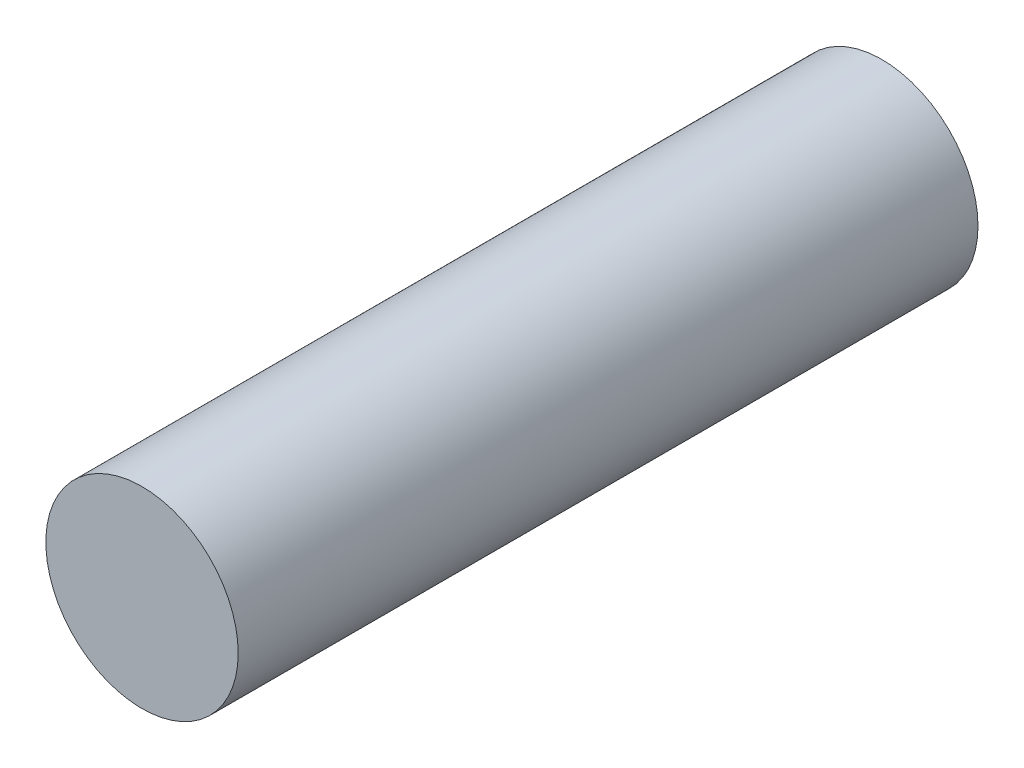
ISO-10303-21;
HEADER;
FILE_DESCRIPTION(('STEP AP214'),'2;1');
FILE_NAME('part.step','',(''),(''),'','','');
FILE_SCHEMA(('AUTOMOTIVE_DESIGN { 1 0 10303 214 1 1 1 1 }'));
ENDSEC;
DATA;
#1=APPLICATION_CONTEXT('core data for automotive mechanical design processes');
#2=APPLICATION_PROTOCOL_DEFINITION('international standard','automotive_design',2000,#1);
#3=PRODUCT_CONTEXT('',#1,'mechanical');
#4=PRODUCT('Part','Part','',(#3));
#5=PRODUCT_RELATED_PRODUCT_CATEGORY('part','',(#4));
#6=PRODUCT_DEFINITION_FORMATION('','',#4);
#7=PRODUCT_DEFINITION_CONTEXT('part definition',#1,'design');
#8=PRODUCT_DEFINITION('design','',#6,#7);
#9=PRODUCT_DEFINITION_SHAPE('','',#8);
#10=(LENGTH_UNIT() NAMED_UNIT(*) SI_UNIT(.MILLI.,.METRE.));
#11=(NAMED_UNIT(*) PLANE_ANGLE_UNIT() SI_UNIT($,.RADIAN.));
#12=(NAMED_UNIT(*) SI_UNIT($,.STERADIAN.) SOLID_ANGLE_UNIT());
#13=UNCERTAINTY_MEASURE_WITH_UNIT(LENGTH_MEASURE(1.E-05),#10,'distance_accuracy_value','');
#14=(GEOMETRIC_REPRESENTATION_CONTEXT(3) GLOBAL_UNCERTAINTY_ASSIGNED_CONTEXT((#13)) GLOBAL_UNIT_ASSIGNED_CONTEXT((#10,
#11,#12)) REPRESENTATION_CONTEXT('',''));
#15=CARTESIAN_POINT('',(0.,0.,0.));
#16=DIRECTION('',(0.,0.,1.));
#17=DIRECTION('',(1.,0.,0.));
#18=AXIS2_PLACEMENT_3D('',#15,#16,#17);
#19=CARTESIAN_POINT('',(0.,0.,5.));
#20=DIRECTION('',(0.,0.,-1.));
#21=DIRECTION('',(-1.,0.,0.));
#22=AXIS2_PLACEMENT_3D('',#19,#20,#21);
#23=CYLINDRICAL_SURFACE('',#22,0.649999999999998);
#24=CARTESIAN_POINT('',(0.,0.,5.));
#25=DIRECTION('',(0.,0.,1.));
#26=DIRECTION('',(1.,0.,0.));
#27=AXIS2_PLACEMENT_3D('',#24,#25,#26);
#28=CIRCLE('',#27,0.649999999999998);
#29=CARTESIAN_POINT('',(0.649999999999998,0.,5.));
#30=VERTEX_POINT('',#29);
#31=EDGE_CURVE('E10',#30,#30,#28,.T.);
#32=ORIENTED_EDGE('',*,*,#31,.F.);
#33=EDGE_LOOP('',(#32));
#34=FACE_BOUND('',#33,.T.);
#35=CARTESIAN_POINT('',(0.,0.,0.));
#36=DIRECTION('',(0.,0.,1.));
#37=DIRECTION('',(1.,0.,0.));
#38=AXIS2_PLACEMENT_3D('',#35,#36,#37);
#39=CIRCLE('',#38,0.649999999999998);
#40=CARTESIAN_POINT('',(0.649999999999998,0.,0.));
#41=VERTEX_POINT('',#40);
#42=EDGE_CURVE('E32',#41,#41,#39,.T.);
#43=ORIENTED_EDGE('',*,*,#42,.T.);
#44=EDGE_LOOP('',(#43));
#45=FACE_BOUND('',#44,.T.);
#46=ADVANCED_FACE('F29',(#34,#45),#23,.T.);
#47=CARTESIAN_POINT('',(0.,0.,5.));
#48=DIRECTION('',(0.,0.,1.));
#49=DIRECTION('',(1.,0.,0.));
#50=AXIS2_PLACEMENT_3D('',#47,#48,#49);
#51=PLANE('',#50);
#52=ORIENTED_EDGE('',*,*,#31,.T.);
#53=EDGE_LOOP('',(#52));
#54=FACE_BOUND('',#53,.T.);
#55=ADVANCED_FACE('F44',(#54),#51,.T.);
#56=CARTESIAN_POINT('',(0.,0.,0.));
#57=DIRECTION('',(0.,0.,1.));
#58=DIRECTION('',(1.,0.,0.));
#59=AXIS2_PLACEMENT_3D('',#56,#57,#58);
#60=PLANE('',#59);
#61=ORIENTED_EDGE('',*,*,#42,.F.);
#62=EDGE_LOOP('',(#61));
#63=FACE_BOUND('',#62,.T.);
#64=ADVANCED_FACE('F42',(#63),#60,.F.);
#65=CLOSED_SHELL('',(#46,#55,#64));
#66=MANIFOLD_SOLID_BREP('B2',#65);
#67=ADVANCED_BREP_SHAPE_REPRESENTATION('',(#18,#66),#14);
#68=SHAPE_DEFINITION_REPRESENTATION(#9,#67);
ENDSEC;
END-ISO-10303-21;
